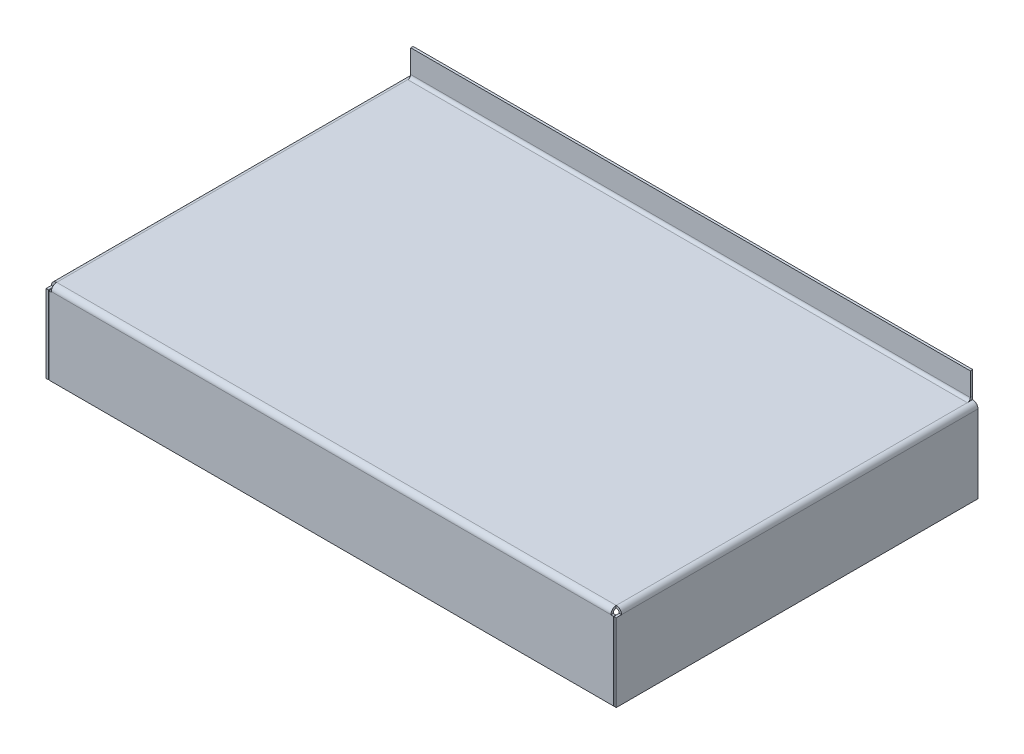
ISO-10303-21;
HEADER;
FILE_DESCRIPTION(('STEP AP214'),'2;1');
FILE_NAME('part.step','',(''),(''),'','','');
FILE_SCHEMA(('AUTOMOTIVE_DESIGN { 1 0 10303 214 1 1 1 1 }'));
ENDSEC;
DATA;
#1=APPLICATION_CONTEXT('core data for automotive mechanical design processes');
#2=APPLICATION_PROTOCOL_DEFINITION('international standard','automotive_design',2000,#1);
#3=PRODUCT_CONTEXT('',#1,'mechanical');
#4=PRODUCT('Part','Part','',(#3));
#5=PRODUCT_RELATED_PRODUCT_CATEGORY('part','',(#4));
#6=PRODUCT_DEFINITION_FORMATION('','',#4);
#7=PRODUCT_DEFINITION_CONTEXT('part definition',#1,'design');
#8=PRODUCT_DEFINITION('design','',#6,#7);
#9=PRODUCT_DEFINITION_SHAPE('','',#8);
#10=(LENGTH_UNIT() NAMED_UNIT(*) SI_UNIT(.MILLI.,.METRE.));
#11=(NAMED_UNIT(*) PLANE_ANGLE_UNIT() SI_UNIT($,.RADIAN.));
#12=(NAMED_UNIT(*) SI_UNIT($,.STERADIAN.) SOLID_ANGLE_UNIT());
#13=UNCERTAINTY_MEASURE_WITH_UNIT(LENGTH_MEASURE(1.E-05),#10,'distance_accuracy_value','');
#14=(GEOMETRIC_REPRESENTATION_CONTEXT(3) GLOBAL_UNCERTAINTY_ASSIGNED_CONTEXT((#13)) GLOBAL_UNIT_ASSIGNED_CONTEXT((#10,
#11,#12)) REPRESENTATION_CONTEXT('',''));
#15=CARTESIAN_POINT('',(0.,0.,0.));
#16=DIRECTION('',(0.,0.,1.));
#17=DIRECTION('',(1.,0.,0.));
#18=AXIS2_PLACEMENT_3D('',#15,#16,#17);
#19=CARTESIAN_POINT('',(-117.75,35.,0.));
#20=DIRECTION('',(1.,0.,0.));
#21=DIRECTION('',(0.,1.,0.));
#22=AXIS2_PLACEMENT_3D('',#19,#20,#21);
#23=PLANE('',#22);
#24=DIRECTION('',(0.,0.,-1.));
#25=VECTOR('',#24,1.);
#26=CARTESIAN_POINT('',(-117.75,35.,150.));
#27=LINE('',#26,#25);
#28=CARTESIAN_POINT('',(-117.75,35.,0.));
#29=VERTEX_POINT('',#28);
#30=CARTESIAN_POINT('',(-117.75,35.,0.379171306613024));
#31=VERTEX_POINT('',#30);
#32=EDGE_CURVE('E472',#29,#31,#27,.F.);
#33=ORIENTED_EDGE('',*,*,#32,.T.);
#34=CARTESIAN_POINT('',(-117.75,36.25,2.24999999999999));
#35=DIRECTION('',(-1.,0.,0.));
#36=DIRECTION('',(0.,0.,1.));
#37=AXIS2_PLACEMENT_3D('',#34,#35,#36);
#38=CIRCLE('',#37,2.25);
#39=CARTESIAN_POINT('',(-117.75,34.,2.25));
#40=VERTEX_POINT('',#39);
#41=EDGE_CURVE('E13',#31,#40,#38,.T.);
#42=ORIENTED_EDGE('',*,*,#41,.T.);
#43=DIRECTION('',(0.,0.,1.));
#44=VECTOR('',#43,1.);
#45=CARTESIAN_POINT('',(-117.75,34.,150.));
#46=LINE('',#45,#44);
#47=CARTESIAN_POINT('',(-117.75,34.,0.));
#48=VERTEX_POINT('',#47);
#49=EDGE_CURVE('E477',#48,#40,#46,.T.);
#50=ORIENTED_EDGE('',*,*,#49,.F.);
#51=DIRECTION('',(0.,1.,0.));
#52=VECTOR('',#51,1.);
#53=CARTESIAN_POINT('',(-117.75,35.,0.));
#54=LINE('',#53,#52);
#55=EDGE_CURVE('E535',#48,#29,#54,.T.);
#56=ORIENTED_EDGE('',*,*,#55,.T.);
#57=EDGE_LOOP('',(#33,#42,#50,#56));
#58=FACE_BOUND('',#57,.T.);
#59=ADVANCED_FACE('F98',(#58),#23,.T.);
#60=CARTESIAN_POINT('',(117.75,35.,2.24999999999999));
#61=DIRECTION('',(-1.,0.,0.));
#62=DIRECTION('',(0.,-1.,0.));
#63=AXIS2_PLACEMENT_3D('',#60,#61,#62);
#64=PLANE('',#63);
#65=DIRECTION('',(0.,0.,1.));
#66=VECTOR('',#65,1.);
#67=CARTESIAN_POINT('',(117.75,34.,150.));
#68=LINE('',#67,#66);
#69=CARTESIAN_POINT('',(117.75,34.,2.24999999999999));
#70=VERTEX_POINT('',#69);
#71=CARTESIAN_POINT('',(117.75,34.,0.));
#72=VERTEX_POINT('',#71);
#73=EDGE_CURVE('E486',#70,#72,#68,.F.);
#74=ORIENTED_EDGE('',*,*,#73,.F.);
#75=CARTESIAN_POINT('',(117.75,36.25,2.24999999999999));
#76=DIRECTION('',(-1.,0.,0.));
#77=DIRECTION('',(0.,0.,1.));
#78=AXIS2_PLACEMENT_3D('',#75,#76,#77);
#79=CIRCLE('',#78,2.25);
#80=CARTESIAN_POINT('',(117.75,35.,0.379171306613013));
#81=VERTEX_POINT('',#80);
#82=EDGE_CURVE('E423',#70,#81,#79,.F.);
#83=ORIENTED_EDGE('',*,*,#82,.T.);
#84=DIRECTION('',(0.,0.,-1.));
#85=VECTOR('',#84,1.);
#86=CARTESIAN_POINT('',(117.75,35.,2.24999999999999));
#87=LINE('',#86,#85);
#88=CARTESIAN_POINT('',(117.75,35.,0.));
#89=VERTEX_POINT('',#88);
#90=EDGE_CURVE('E425',#81,#89,#87,.T.);
#91=ORIENTED_EDGE('',*,*,#90,.T.);
#92=DIRECTION('',(0.,1.,0.));
#93=VECTOR('',#92,1.);
#94=CARTESIAN_POINT('',(117.75,35.,0.));
#95=LINE('',#94,#93);
#96=EDGE_CURVE('E107',#72,#89,#95,.T.);
#97=ORIENTED_EDGE('',*,*,#96,.F.);
#98=EDGE_LOOP('',(#74,#83,#91,#97));
#99=FACE_BOUND('',#98,.T.);
#100=ADVANCED_FACE('F566',(#99),#64,.T.);
#101=CARTESIAN_POINT('',(-120.,35.,150.));
#102=DIRECTION('',(0.,-1.,0.));
#103=DIRECTION('',(1.,0.,0.));
#104=AXIS2_PLACEMENT_3D('',#101,#102,#103);
#105=PLANE('',#104);
#106=DIRECTION('',(-1.,0.,0.));
#107=VECTOR('',#106,1.);
#108=CARTESIAN_POINT('',(-117.75,35.,2.24999999999999));
#109=LINE('',#108,#107);
#110=CARTESIAN_POINT('',(-117.75,35.,2.24999999999999));
#111=VERTEX_POINT('',#110);
#112=CARTESIAN_POINT('',(117.75,35.,2.24999999999999));
#113=VERTEX_POINT('',#112);
#114=EDGE_CURVE('E431',#111,#113,#109,.F.);
#115=ORIENTED_EDGE('',*,*,#114,.F.);
#116=CARTESIAN_POINT('',(-117.75,35.,150.));
#117=VERTEX_POINT('',#116);
#118=EDGE_CURVE('E471',#111,#117,#27,.F.);
#119=ORIENTED_EDGE('',*,*,#118,.T.);
#120=DIRECTION('',(-1.,0.,0.));
#121=VECTOR('',#120,1.);
#122=CARTESIAN_POINT('',(-120.,35.,150.));
#123=LINE('',#122,#121);
#124=CARTESIAN_POINT('',(117.75,35.,150.));
#125=VERTEX_POINT('',#124);
#126=EDGE_CURVE('E447',#125,#117,#123,.T.);
#127=ORIENTED_EDGE('',*,*,#126,.F.);
#128=DIRECTION('',(0.,0.,-1.));
#129=VECTOR('',#128,1.);
#130=CARTESIAN_POINT('',(117.75,35.,150.));
#131=LINE('',#130,#129);
#132=EDGE_CURVE('E456',#125,#113,#131,.T.);
#133=ORIENTED_EDGE('',*,*,#132,.T.);
#134=EDGE_LOOP('',(#115,#119,#127,#133));
#135=FACE_BOUND('',#134,.T.);
#136=ADVANCED_FACE('F578',(#135),#105,.F.);
#137=CARTESIAN_POINT('',(-120.,34.,150.));
#138=DIRECTION('',(0.,-1.,0.));
#139=DIRECTION('',(1.,0.,0.));
#140=AXIS2_PLACEMENT_3D('',#137,#138,#139);
#141=PLANE('',#140);
#142=CARTESIAN_POINT('',(-117.75,34.,150.));
#143=VERTEX_POINT('',#142);
#144=EDGE_CURVE('E489',#40,#143,#46,.T.);
#145=ORIENTED_EDGE('',*,*,#144,.F.);
#146=DIRECTION('',(-1.,0.,0.));
#147=VECTOR('',#146,1.);
#148=CARTESIAN_POINT('',(-117.75,34.,2.24999999999999));
#149=LINE('',#148,#147);
#150=EDGE_CURVE('E419',#40,#70,#149,.F.);
#151=ORIENTED_EDGE('',*,*,#150,.T.);
#152=CARTESIAN_POINT('',(117.75,34.,150.));
#153=VERTEX_POINT('',#152);
#154=EDGE_CURVE('E483',#153,#70,#68,.F.);
#155=ORIENTED_EDGE('',*,*,#154,.F.);
#156=DIRECTION('',(1.,0.,0.));
#157=VECTOR('',#156,1.);
#158=CARTESIAN_POINT('',(-120.,34.,150.));
#159=LINE('',#158,#157);
#160=EDGE_CURVE('E496',#153,#143,#159,.F.);
#161=ORIENTED_EDGE('',*,*,#160,.T.);
#162=EDGE_LOOP('',(#145,#151,#155,#161));
#163=FACE_BOUND('',#162,.T.);
#164=ADVANCED_FACE('F569',(#163),#141,.T.);
#165=CARTESIAN_POINT('',(-117.75,32.75,0.));
#166=DIRECTION('',(0.,0.,1.));
#167=DIRECTION('',(1.,0.,0.));
#168=AXIS2_PLACEMENT_3D('',#165,#166,#167);
#169=PLANE('',#168);
#170=ORIENTED_EDGE('',*,*,#55,.F.);
#171=CARTESIAN_POINT('',(-117.75,32.75,0.));
#172=DIRECTION('',(0.,0.,-1.));
#173=DIRECTION('',(-1.,0.,0.));
#174=AXIS2_PLACEMENT_3D('',#171,#172,#173);
#175=CIRCLE('',#174,1.25);
#176=CARTESIAN_POINT('',(-119.,32.75,0.));
#177=VERTEX_POINT('',#176);
#178=EDGE_CURVE('E439',#48,#177,#175,.F.);
#179=ORIENTED_EDGE('',*,*,#178,.T.);
#180=DIRECTION('',(-1.,0.,0.));
#181=VECTOR('',#180,1.);
#182=CARTESIAN_POINT('',(-120.,32.75,0.));
#183=LINE('',#182,#181);
#184=CARTESIAN_POINT('',(-120.,32.75,0.));
#185=VERTEX_POINT('',#184);
#186=EDGE_CURVE('E533',#177,#185,#183,.T.);
#187=ORIENTED_EDGE('',*,*,#186,.T.);
#188=CARTESIAN_POINT('',(-117.75,32.75,0.));
#189=DIRECTION('',(0.,0.,-1.));
#190=DIRECTION('',(-1.,0.,0.));
#191=AXIS2_PLACEMENT_3D('',#188,#189,#190);
#192=CIRCLE('',#191,2.25);
#193=EDGE_CURVE('E474',#29,#185,#192,.F.);
#194=ORIENTED_EDGE('',*,*,#193,.F.);
#195=EDGE_LOOP('',(#170,#179,#187,#194));
#196=FACE_BOUND('',#195,.T.);
#197=ADVANCED_FACE('F640',(#196),#169,.F.);
#198=CARTESIAN_POINT('',(-120.,0.,0.));
#199=DIRECTION('',(0.,0.,1.));
#200=DIRECTION('',(0.,-1.,0.));
#201=AXIS2_PLACEMENT_3D('',#198,#199,#200);
#202=PLANE('',#201);
#203=ORIENTED_EDGE('',*,*,#186,.F.);
#204=DIRECTION('',(0.,1.,0.));
#205=VECTOR('',#204,1.);
#206=CARTESIAN_POINT('',(-119.,0.,0.));
#207=LINE('',#206,#205);
#208=CARTESIAN_POINT('',(-119.,0.,0.));
#209=VERTEX_POINT('',#208);
#210=EDGE_CURVE('E502',#177,#209,#207,.F.);
#211=ORIENTED_EDGE('',*,*,#210,.T.);
#212=DIRECTION('',(-1.,0.,0.));
#213=VECTOR('',#212,1.);
#214=CARTESIAN_POINT('',(-120.,0.,0.));
#215=LINE('',#214,#213);
#216=CARTESIAN_POINT('',(-120.,0.,0.));
#217=VERTEX_POINT('',#216);
#218=EDGE_CURVE('E531',#209,#217,#215,.T.);
#219=ORIENTED_EDGE('',*,*,#218,.T.);
#220=DIRECTION('',(0.,-1.,0.));
#221=VECTOR('',#220,1.);
#222=CARTESIAN_POINT('',(-120.,0.,0.));
#223=LINE('',#222,#221);
#224=EDGE_CURVE('E440',#185,#217,#223,.T.);
#225=ORIENTED_EDGE('',*,*,#224,.F.);
#226=EDGE_LOOP('',(#203,#211,#219,#225));
#227=FACE_BOUND('',#226,.T.);
#228=ADVANCED_FACE('F667',(#227),#202,.F.);
#229=CARTESIAN_POINT('',(-120.,0.,150.));
#230=DIRECTION('',(0.,-1.,0.));
#231=DIRECTION('',(0.,0.,-1.));
#232=AXIS2_PLACEMENT_3D('',#229,#230,#231);
#233=PLANE('',#232);
#234=ORIENTED_EDGE('',*,*,#218,.F.);
#235=DIRECTION('',(0.,0.,-1.));
#236=VECTOR('',#235,1.);
#237=CARTESIAN_POINT('',(-119.,0.,150.));
#238=LINE('',#237,#236);
#239=CARTESIAN_POINT('',(-119.,0.,152.25));
#240=VERTEX_POINT('',#239);
#241=EDGE_CURVE('E506',#240,#209,#238,.T.);
#242=ORIENTED_EDGE('',*,*,#241,.F.);
#243=DIRECTION('',(1.,0.,0.));
#244=VECTOR('',#243,1.);
#245=CARTESIAN_POINT('',(-120.,0.,152.25));
#246=LINE('',#245,#244);
#247=CARTESIAN_POINT('',(-120.,0.,152.25));
#248=VERTEX_POINT('',#247);
#249=EDGE_CURVE('E375',#248,#240,#246,.T.);
#250=ORIENTED_EDGE('',*,*,#249,.F.);
#251=DIRECTION('',(0.,0.,-1.));
#252=VECTOR('',#251,1.);
#253=CARTESIAN_POINT('',(-120.,0.,150.));
#254=LINE('',#253,#252);
#255=EDGE_CURVE('E443',#248,#217,#254,.T.);
#256=ORIENTED_EDGE('',*,*,#255,.T.);
#257=EDGE_LOOP('',(#234,#242,#250,#256));
#258=FACE_BOUND('',#257,.T.);
#259=ADVANCED_FACE('F663',(#258),#233,.T.);
#260=CARTESIAN_POINT('',(-117.75,32.75,150.));
#261=DIRECTION('',(0.,0.,-1.));
#262=DIRECTION('',(-1.,0.,0.));
#263=AXIS2_PLACEMENT_3D('',#260,#261,#262);
#264=PLANE('',#263);
#265=DIRECTION('',(-1.,0.,0.));
#266=VECTOR('',#265,1.);
#267=CARTESIAN_POINT('',(-120.,32.75,150.));
#268=LINE('',#267,#266);
#269=CARTESIAN_POINT('',(-119.,32.75,150.));
#270=VERTEX_POINT('',#269);
#271=CARTESIAN_POINT('',(-120.,32.75,150.));
#272=VERTEX_POINT('',#271);
#273=EDGE_CURVE('E529',#270,#272,#268,.T.);
#274=ORIENTED_EDGE('',*,*,#273,.F.);
#275=CARTESIAN_POINT('',(-117.75,32.75,150.));
#276=DIRECTION('',(0.,0.,-1.));
#277=DIRECTION('',(-1.,0.,0.));
#278=AXIS2_PLACEMENT_3D('',#275,#276,#277);
#279=CIRCLE('',#278,1.25);
#280=EDGE_CURVE('E507',#270,#143,#279,.T.);
#281=ORIENTED_EDGE('',*,*,#280,.T.);
#282=DIRECTION('',(0.,1.,0.));
#283=VECTOR('',#282,1.);
#284=CARTESIAN_POINT('',(-117.75,35.,150.));
#285=LINE('',#284,#283);
#286=EDGE_CURVE('E526',#143,#117,#285,.T.);
#287=ORIENTED_EDGE('',*,*,#286,.T.);
#288=CARTESIAN_POINT('',(-117.75,32.75,150.));
#289=DIRECTION('',(0.,0.,1.));
#290=DIRECTION('',(1.,0.,0.));
#291=AXIS2_PLACEMENT_3D('',#288,#289,#290);
#292=CIRCLE('',#291,2.25);
#293=EDGE_CURVE('E466',#272,#117,#292,.F.);
#294=ORIENTED_EDGE('',*,*,#293,.F.);
#295=EDGE_LOOP('',(#274,#281,#287,#294));
#296=FACE_BOUND('',#295,.T.);
#297=ADVANCED_FACE('F659',(#296),#264,.F.);
#298=CARTESIAN_POINT('',(117.75,32.75,150.));
#299=DIRECTION('',(0.,0.,-1.));
#300=DIRECTION('',(-1.,0.,0.));
#301=AXIS2_PLACEMENT_3D('',#298,#299,#300);
#302=PLANE('',#301);
#303=DIRECTION('',(0.,1.,0.));
#304=VECTOR('',#303,1.);
#305=CARTESIAN_POINT('',(117.75,35.,150.));
#306=LINE('',#305,#304);
#307=EDGE_CURVE('E523',#153,#125,#306,.T.);
#308=ORIENTED_EDGE('',*,*,#307,.F.);
#309=CARTESIAN_POINT('',(117.75,32.75,150.));
#310=DIRECTION('',(0.,0.,-1.));
#311=DIRECTION('',(-1.,0.,0.));
#312=AXIS2_PLACEMENT_3D('',#309,#310,#311);
#313=CIRCLE('',#312,1.25);
#314=CARTESIAN_POINT('',(119.,32.75,150.));
#315=VERTEX_POINT('',#314);
#316=EDGE_CURVE('E499',#153,#315,#313,.T.);
#317=ORIENTED_EDGE('',*,*,#316,.T.);
#318=DIRECTION('',(1.,0.,0.));
#319=VECTOR('',#318,1.);
#320=CARTESIAN_POINT('',(120.,32.75,150.));
#321=LINE('',#320,#319);
#322=CARTESIAN_POINT('',(120.,32.75,150.));
#323=VERTEX_POINT('',#322);
#324=EDGE_CURVE('E520',#315,#323,#321,.T.);
#325=ORIENTED_EDGE('',*,*,#324,.T.);
#326=CARTESIAN_POINT('',(117.75,32.75,150.));
#327=DIRECTION('',(0.,0.,1.));
#328=DIRECTION('',(1.,0.,0.));
#329=AXIS2_PLACEMENT_3D('',#326,#327,#328);
#330=CIRCLE('',#329,2.25);
#331=EDGE_CURVE('E444',#125,#323,#330,.F.);
#332=ORIENTED_EDGE('',*,*,#331,.F.);
#333=EDGE_LOOP('',(#308,#317,#325,#332));
#334=FACE_BOUND('',#333,.T.);
#335=ADVANCED_FACE('F655',(#334),#302,.F.);
#336=CARTESIAN_POINT('',(120.,0.,150.));
#337=DIRECTION('',(0.,1.,0.));
#338=DIRECTION('',(0.,0.,-1.));
#339=AXIS2_PLACEMENT_3D('',#336,#337,#338);
#340=PLANE('',#339);
#341=DIRECTION('',(0.,0.,-1.));
#342=VECTOR('',#341,1.);
#343=CARTESIAN_POINT('',(120.,0.,150.));
#344=LINE('',#343,#342);
#345=CARTESIAN_POINT('',(120.,0.,152.25));
#346=VERTEX_POINT('',#345);
#347=CARTESIAN_POINT('',(120.,0.,0.));
#348=VERTEX_POINT('',#347);
#349=EDGE_CURVE('E453',#346,#348,#344,.T.);
#350=ORIENTED_EDGE('',*,*,#349,.F.);
#351=DIRECTION('',(1.,0.,0.));
#352=VECTOR('',#351,1.);
#353=CARTESIAN_POINT('',(119.,0.,152.25));
#354=LINE('',#353,#352);
#355=CARTESIAN_POINT('',(119.,0.,152.25));
#356=VERTEX_POINT('',#355);
#357=EDGE_CURVE('E365',#356,#346,#354,.T.);
#358=ORIENTED_EDGE('',*,*,#357,.F.);
#359=DIRECTION('',(0.,0.,1.));
#360=VECTOR('',#359,1.);
#361=CARTESIAN_POINT('',(119.,0.,150.));
#362=LINE('',#361,#360);
#363=CARTESIAN_POINT('',(119.,0.,0.));
#364=VERTEX_POINT('',#363);
#365=EDGE_CURVE('E495',#356,#364,#362,.F.);
#366=ORIENTED_EDGE('',*,*,#365,.T.);
#367=DIRECTION('',(1.,0.,0.));
#368=VECTOR('',#367,1.);
#369=CARTESIAN_POINT('',(120.,0.,0.));
#370=LINE('',#369,#368);
#371=EDGE_CURVE('E518',#364,#348,#370,.T.);
#372=ORIENTED_EDGE('',*,*,#371,.T.);
#373=EDGE_LOOP('',(#350,#358,#366,#372));
#374=FACE_BOUND('',#373,.T.);
#375=ADVANCED_FACE('F652',(#374),#340,.F.);
#376=CARTESIAN_POINT('',(120.,35.,0.));
#377=DIRECTION('',(0.,0.,1.));
#378=DIRECTION('',(0.,1.,0.));
#379=AXIS2_PLACEMENT_3D('',#376,#377,#378);
#380=PLANE('',#379);
#381=ORIENTED_EDGE('',*,*,#371,.F.);
#382=DIRECTION('',(0.,1.,0.));
#383=VECTOR('',#382,1.);
#384=CARTESIAN_POINT('',(119.,35.,0.));
#385=LINE('',#384,#383);
#386=CARTESIAN_POINT('',(119.,32.75,0.));
#387=VERTEX_POINT('',#386);
#388=EDGE_CURVE('E492',#364,#387,#385,.T.);
#389=ORIENTED_EDGE('',*,*,#388,.T.);
#390=DIRECTION('',(1.,0.,0.));
#391=VECTOR('',#390,1.);
#392=CARTESIAN_POINT('',(120.,32.75,0.));
#393=LINE('',#392,#391);
#394=CARTESIAN_POINT('',(120.,32.75,0.));
#395=VERTEX_POINT('',#394);
#396=EDGE_CURVE('E102',#387,#395,#393,.T.);
#397=ORIENTED_EDGE('',*,*,#396,.T.);
#398=DIRECTION('',(0.,1.,0.));
#399=VECTOR('',#398,1.);
#400=CARTESIAN_POINT('',(120.,35.,0.));
#401=LINE('',#400,#399);
#402=EDGE_CURVE('E450',#348,#395,#401,.T.);
#403=ORIENTED_EDGE('',*,*,#402,.F.);
#404=EDGE_LOOP('',(#381,#389,#397,#403));
#405=FACE_BOUND('',#404,.T.);
#406=ADVANCED_FACE('F553',(#405),#380,.F.);
#407=CARTESIAN_POINT('',(117.75,32.75,0.));
#408=DIRECTION('',(0.,0.,1.));
#409=DIRECTION('',(1.,0.,0.));
#410=AXIS2_PLACEMENT_3D('',#407,#408,#409);
#411=PLANE('',#410);
#412=CARTESIAN_POINT('',(117.75,32.75,0.));
#413=DIRECTION('',(0.,0.,-1.));
#414=DIRECTION('',(-1.,0.,0.));
#415=AXIS2_PLACEMENT_3D('',#412,#413,#414);
#416=CIRCLE('',#415,1.25);
#417=EDGE_CURVE('E503',#387,#72,#416,.F.);
#418=ORIENTED_EDGE('',*,*,#417,.T.);
#419=ORIENTED_EDGE('',*,*,#96,.T.);
#420=CARTESIAN_POINT('',(117.75,32.75,0.));
#421=DIRECTION('',(0.,0.,-1.));
#422=DIRECTION('',(-1.,0.,0.));
#423=AXIS2_PLACEMENT_3D('',#420,#421,#422);
#424=CIRCLE('',#423,2.25);
#425=EDGE_CURVE('E463',#395,#89,#424,.F.);
#426=ORIENTED_EDGE('',*,*,#425,.F.);
#427=ORIENTED_EDGE('',*,*,#396,.F.);
#428=EDGE_LOOP('',(#418,#419,#426,#427));
#429=FACE_BOUND('',#428,.T.);
#430=ADVANCED_FACE('F100',(#429),#411,.F.);
#431=CARTESIAN_POINT('',(120.,35.,150.));
#432=DIRECTION('',(-1.,0.,0.));
#433=DIRECTION('',(0.,0.,1.));
#434=AXIS2_PLACEMENT_3D('',#431,#432,#433);
#435=PLANE('',#434);
#436=ORIENTED_EDGE('',*,*,#402,.T.);
#437=DIRECTION('',(0.,0.,-1.));
#438=VECTOR('',#437,1.);
#439=CARTESIAN_POINT('',(120.,32.75,150.));
#440=LINE('',#439,#438);
#441=EDGE_CURVE('E459',#395,#323,#440,.F.);
#442=ORIENTED_EDGE('',*,*,#441,.T.);
#443=DIRECTION('',(0.,0.,-1.));
#444=VECTOR('',#443,1.);
#445=CARTESIAN_POINT('',(120.,32.75,152.25));
#446=LINE('',#445,#444);
#447=CARTESIAN_POINT('',(120.,32.75,152.25));
#448=VERTEX_POINT('',#447);
#449=EDGE_CURVE('E370',#448,#323,#446,.T.);
#450=ORIENTED_EDGE('',*,*,#449,.F.);
#451=DIRECTION('',(0.,1.,0.));
#452=VECTOR('',#451,1.);
#453=CARTESIAN_POINT('',(120.,0.,152.25));
#454=LINE('',#453,#452);
#455=EDGE_CURVE('E347',#346,#448,#454,.T.);
#456=ORIENTED_EDGE('',*,*,#455,.F.);
#457=ORIENTED_EDGE('',*,*,#349,.T.);
#458=EDGE_LOOP('',(#436,#442,#450,#456,#457));
#459=FACE_BOUND('',#458,.T.);
#460=ADVANCED_FACE('F549',(#459),#435,.F.);
#461=CARTESIAN_POINT('',(-120.,0.,150.));
#462=DIRECTION('',(1.,0.,0.));
#463=DIRECTION('',(0.,0.,-1.));
#464=AXIS2_PLACEMENT_3D('',#461,#462,#463);
#465=PLANE('',#464);
#466=ORIENTED_EDGE('',*,*,#255,.F.);
#467=DIRECTION('',(0.,-1.,0.));
#468=VECTOR('',#467,1.);
#469=CARTESIAN_POINT('',(-120.,32.75,152.25));
#470=LINE('',#469,#468);
#471=CARTESIAN_POINT('',(-120.,32.75,152.25));
#472=VERTEX_POINT('',#471);
#473=EDGE_CURVE('E372',#472,#248,#470,.T.);
#474=ORIENTED_EDGE('',*,*,#473,.F.);
#475=DIRECTION('',(0.,0.,-1.));
#476=VECTOR('',#475,1.);
#477=CARTESIAN_POINT('',(-120.,32.75,152.25));
#478=LINE('',#477,#476);
#479=EDGE_CURVE('E382',#472,#272,#478,.T.);
#480=ORIENTED_EDGE('',*,*,#479,.T.);
#481=DIRECTION('',(0.,0.,-1.));
#482=VECTOR('',#481,1.);
#483=CARTESIAN_POINT('',(-120.,32.75,150.));
#484=LINE('',#483,#482);
#485=EDGE_CURVE('E462',#272,#185,#484,.T.);
#486=ORIENTED_EDGE('',*,*,#485,.T.);
#487=ORIENTED_EDGE('',*,*,#224,.T.);
#488=EDGE_LOOP('',(#466,#474,#480,#486,#487));
#489=FACE_BOUND('',#488,.T.);
#490=ADVANCED_FACE('F622',(#489),#465,.F.);
#491=CARTESIAN_POINT('',(117.75,32.75,150.));
#492=DIRECTION('',(0.,0.,-1.));
#493=DIRECTION('',(-1.,0.,0.));
#494=AXIS2_PLACEMENT_3D('',#491,#492,#493);
#495=CYLINDRICAL_SURFACE('',#494,2.25);
#496=ORIENTED_EDGE('',*,*,#331,.T.);
#497=ORIENTED_EDGE('',*,*,#441,.F.);
#498=ORIENTED_EDGE('',*,*,#425,.T.);
#499=ORIENTED_EDGE('',*,*,#90,.F.);
#500=EDGE_CURVE('E436',#113,#81,#87,.T.);
#501=ORIENTED_EDGE('',*,*,#500,.F.);
#502=ORIENTED_EDGE('',*,*,#132,.F.);
#503=EDGE_LOOP('',(#496,#497,#498,#499,#501,#502));
#504=FACE_BOUND('',#503,.T.);
#505=ADVANCED_FACE('F544',(#504),#495,.T.);
#506=CARTESIAN_POINT('',(-117.75,32.75,150.));
#507=DIRECTION('',(0.,0.,-1.));
#508=DIRECTION('',(-1.,0.,0.));
#509=AXIS2_PLACEMENT_3D('',#506,#507,#508);
#510=CYLINDRICAL_SURFACE('',#509,2.25);
#511=ORIENTED_EDGE('',*,*,#293,.T.);
#512=ORIENTED_EDGE('',*,*,#118,.F.);
#513=EDGE_CURVE('E116',#31,#111,#27,.F.);
#514=ORIENTED_EDGE('',*,*,#513,.F.);
#515=ORIENTED_EDGE('',*,*,#32,.F.);
#516=ORIENTED_EDGE('',*,*,#193,.T.);
#517=ORIENTED_EDGE('',*,*,#485,.F.);
#518=EDGE_LOOP('',(#511,#512,#514,#515,#516,#517));
#519=FACE_BOUND('',#518,.T.);
#520=ADVANCED_FACE('F632',(#519),#510,.T.);
#521=CARTESIAN_POINT('',(119.,35.,150.));
#522=DIRECTION('',(-1.,0.,0.));
#523=DIRECTION('',(0.,0.,1.));
#524=AXIS2_PLACEMENT_3D('',#521,#522,#523);
#525=PLANE('',#524);
#526=ORIENTED_EDGE('',*,*,#388,.F.);
#527=ORIENTED_EDGE('',*,*,#365,.F.);
#528=DIRECTION('',(0.,-1.,0.));
#529=VECTOR('',#528,1.);
#530=CARTESIAN_POINT('',(119.,32.75,152.25));
#531=LINE('',#530,#529);
#532=CARTESIAN_POINT('',(119.,32.75,152.25));
#533=VERTEX_POINT('',#532);
#534=EDGE_CURVE('E362',#533,#356,#531,.T.);
#535=ORIENTED_EDGE('',*,*,#534,.F.);
#536=DIRECTION('',(0.,0.,-1.));
#537=VECTOR('',#536,1.);
#538=CARTESIAN_POINT('',(119.,32.75,152.25));
#539=LINE('',#538,#537);
#540=EDGE_CURVE('E368',#533,#315,#539,.T.);
#541=ORIENTED_EDGE('',*,*,#540,.T.);
#542=DIRECTION('',(0.,0.,1.));
#543=VECTOR('',#542,1.);
#544=CARTESIAN_POINT('',(119.,32.75,150.));
#545=LINE('',#544,#543);
#546=EDGE_CURVE('E479',#387,#315,#545,.T.);
#547=ORIENTED_EDGE('',*,*,#546,.F.);
#548=EDGE_LOOP('',(#526,#527,#535,#541,#547));
#549=FACE_BOUND('',#548,.T.);
#550=ADVANCED_FACE('F557',(#549),#525,.T.);
#551=CARTESIAN_POINT('',(-119.,0.,150.));
#552=DIRECTION('',(1.,0.,0.));
#553=DIRECTION('',(0.,0.,-1.));
#554=AXIS2_PLACEMENT_3D('',#551,#552,#553);
#555=PLANE('',#554);
#556=DIRECTION('',(0.,0.,-1.));
#557=VECTOR('',#556,1.);
#558=CARTESIAN_POINT('',(-119.,32.75,150.));
#559=LINE('',#558,#557);
#560=EDGE_CURVE('E482',#270,#177,#559,.T.);
#561=ORIENTED_EDGE('',*,*,#560,.F.);
#562=DIRECTION('',(0.,0.,-1.));
#563=VECTOR('',#562,1.);
#564=CARTESIAN_POINT('',(-119.,32.75,152.25));
#565=LINE('',#564,#563);
#566=CARTESIAN_POINT('',(-119.,32.75,152.25));
#567=VERTEX_POINT('',#566);
#568=EDGE_CURVE('E385',#567,#270,#565,.T.);
#569=ORIENTED_EDGE('',*,*,#568,.F.);
#570=DIRECTION('',(0.,1.,0.));
#571=VECTOR('',#570,1.);
#572=CARTESIAN_POINT('',(-119.,0.,152.25));
#573=LINE('',#572,#571);
#574=EDGE_CURVE('E378',#240,#567,#573,.T.);
#575=ORIENTED_EDGE('',*,*,#574,.F.);
#576=ORIENTED_EDGE('',*,*,#241,.T.);
#577=ORIENTED_EDGE('',*,*,#210,.F.);
#578=EDGE_LOOP('',(#561,#569,#575,#576,#577));
#579=FACE_BOUND('',#578,.T.);
#580=ADVANCED_FACE('F637',(#579),#555,.T.);
#581=CARTESIAN_POINT('',(117.75,32.75,150.));
#582=DIRECTION('',(0.,0.,-1.));
#583=DIRECTION('',(-1.,0.,0.));
#584=AXIS2_PLACEMENT_3D('',#581,#582,#583);
#585=CYLINDRICAL_SURFACE('',#584,1.25);
#586=ORIENTED_EDGE('',*,*,#316,.F.);
#587=ORIENTED_EDGE('',*,*,#154,.T.);
#588=ORIENTED_EDGE('',*,*,#73,.T.);
#589=ORIENTED_EDGE('',*,*,#417,.F.);
#590=ORIENTED_EDGE('',*,*,#546,.T.);
#591=EDGE_LOOP('',(#586,#587,#588,#589,#590));
#592=FACE_BOUND('',#591,.T.);
#593=ADVANCED_FACE('F563',(#592),#585,.F.);
#594=CARTESIAN_POINT('',(-117.75,32.75,150.));
#595=DIRECTION('',(0.,0.,-1.));
#596=DIRECTION('',(-1.,0.,0.));
#597=AXIS2_PLACEMENT_3D('',#594,#595,#596);
#598=CYLINDRICAL_SURFACE('',#597,1.25);
#599=ORIENTED_EDGE('',*,*,#280,.F.);
#600=ORIENTED_EDGE('',*,*,#560,.T.);
#601=ORIENTED_EDGE('',*,*,#178,.F.);
#602=ORIENTED_EDGE('',*,*,#49,.T.);
#603=ORIENTED_EDGE('',*,*,#144,.T.);
#604=EDGE_LOOP('',(#599,#600,#601,#602,#603));
#605=FACE_BOUND('',#604,.T.);
#606=ADVANCED_FACE('F646',(#605),#598,.F.);
#607=CARTESIAN_POINT('',(117.75,36.25,2.24999999999999));
#608=DIRECTION('',(1.,0.,0.));
#609=DIRECTION('',(0.,0.,-1.));
#610=AXIS2_PLACEMENT_3D('',#607,#608,#609);
#611=PLANE('',#610);
#612=CARTESIAN_POINT('',(117.75,36.25,2.24999999999999));
#613=DIRECTION('',(-1.,0.,0.));
#614=DIRECTION('',(0.,0.,1.));
#615=AXIS2_PLACEMENT_3D('',#612,#613,#614);
#616=CIRCLE('',#615,1.25);
#617=CARTESIAN_POINT('',(117.75,36.25,0.999999999999994));
#618=VERTEX_POINT('',#617);
#619=EDGE_CURVE('E428',#113,#618,#616,.F.);
#620=ORIENTED_EDGE('',*,*,#619,.F.);
#621=ORIENTED_EDGE('',*,*,#500,.T.);
#622=CARTESIAN_POINT('',(117.75,36.25,0.));
#623=VERTEX_POINT('',#622);
#624=EDGE_CURVE('E422',#81,#623,#79,.F.);
#625=ORIENTED_EDGE('',*,*,#624,.T.);
#626=DIRECTION('',(0.,0.,1.));
#627=VECTOR('',#626,1.);
#628=CARTESIAN_POINT('',(117.75,36.25,0.));
#629=LINE('',#628,#627);
#630=EDGE_CURVE('E387',#618,#623,#629,.F.);
#631=ORIENTED_EDGE('',*,*,#630,.F.);
#632=EDGE_LOOP('',(#620,#621,#625,#631));
#633=FACE_BOUND('',#632,.T.);
#634=ADVANCED_FACE('F576',(#633),#611,.T.);
#635=CARTESIAN_POINT('',(-117.75,36.25,2.24999999999999));
#636=DIRECTION('',(1.,0.,0.));
#637=DIRECTION('',(0.,0.,-1.));
#638=AXIS2_PLACEMENT_3D('',#635,#636,#637);
#639=PLANE('',#638);
#640=CARTESIAN_POINT('',(-117.75,36.25,0.));
#641=VERTEX_POINT('',#640);
#642=EDGE_CURVE('E109',#641,#31,#38,.T.);
#643=ORIENTED_EDGE('',*,*,#642,.T.);
#644=ORIENTED_EDGE('',*,*,#513,.T.);
#645=CARTESIAN_POINT('',(-117.75,36.25,2.24999999999999));
#646=DIRECTION('',(-1.,0.,0.));
#647=DIRECTION('',(0.,0.,1.));
#648=AXIS2_PLACEMENT_3D('',#645,#646,#647);
#649=CIRCLE('',#648,1.25);
#650=CARTESIAN_POINT('',(-117.75,36.25,0.999999999999994));
#651=VERTEX_POINT('',#650);
#652=EDGE_CURVE('E391',#651,#111,#649,.T.);
#653=ORIENTED_EDGE('',*,*,#652,.F.);
#654=DIRECTION('',(0.,0.,1.));
#655=VECTOR('',#654,1.);
#656=CARTESIAN_POINT('',(-117.75,36.25,0.999999999999993));
#657=LINE('',#656,#655);
#658=EDGE_CURVE('E412',#651,#641,#657,.F.);
#659=ORIENTED_EDGE('',*,*,#658,.T.);
#660=EDGE_LOOP('',(#643,#644,#653,#659));
#661=FACE_BOUND('',#660,.T.);
#662=ADVANCED_FACE('F586',(#661),#639,.F.);
#663=CARTESIAN_POINT('',(-117.75,36.25,2.24999999999999));
#664=DIRECTION('',(-1.,0.,0.));
#665=DIRECTION('',(0.,0.,-1.));
#666=AXIS2_PLACEMENT_3D('',#663,#664,#665);
#667=CYLINDRICAL_SURFACE('',#666,2.25);
#668=ORIENTED_EDGE('',*,*,#150,.F.);
#669=ORIENTED_EDGE('',*,*,#41,.F.);
#670=ORIENTED_EDGE('',*,*,#642,.F.);
#671=DIRECTION('',(-1.,0.,0.));
#672=VECTOR('',#671,1.);
#673=CARTESIAN_POINT('',(117.75,36.25,0.));
#674=LINE('',#673,#672);
#675=EDGE_CURVE('E409',#641,#623,#674,.F.);
#676=ORIENTED_EDGE('',*,*,#675,.T.);
#677=ORIENTED_EDGE('',*,*,#624,.F.);
#678=ORIENTED_EDGE('',*,*,#82,.F.);
#679=EDGE_LOOP('',(#668,#669,#670,#676,#677,#678));
#680=FACE_BOUND('',#679,.T.);
#681=ADVANCED_FACE('F571',(#680),#667,.T.);
#682=CARTESIAN_POINT('',(-117.75,36.25,2.24999999999999));
#683=DIRECTION('',(-1.,0.,0.));
#684=DIRECTION('',(0.,0.,-1.));
#685=AXIS2_PLACEMENT_3D('',#682,#683,#684);
#686=CYLINDRICAL_SURFACE('',#685,1.25);
#687=ORIENTED_EDGE('',*,*,#114,.T.);
#688=ORIENTED_EDGE('',*,*,#619,.T.);
#689=DIRECTION('',(-1.,0.,0.));
#690=VECTOR('',#689,1.);
#691=CARTESIAN_POINT('',(117.75,36.25,0.999999999999993));
#692=LINE('',#691,#690);
#693=EDGE_CURVE('E415',#618,#651,#692,.T.);
#694=ORIENTED_EDGE('',*,*,#693,.T.);
#695=ORIENTED_EDGE('',*,*,#652,.T.);
#696=EDGE_LOOP('',(#687,#688,#694,#695));
#697=FACE_BOUND('',#696,.T.);
#698=ADVANCED_FACE('F581',(#697),#686,.F.);
#699=CARTESIAN_POINT('',(-117.75,46.,0.));
#700=DIRECTION('',(1.,0.,0.));
#701=DIRECTION('',(0.,0.,-1.));
#702=AXIS2_PLACEMENT_3D('',#699,#700,#701);
#703=PLANE('',#702);
#704=ORIENTED_EDGE('',*,*,#658,.F.);
#705=DIRECTION('',(0.,-1.,0.));
#706=VECTOR('',#705,1.);
#707=CARTESIAN_POINT('',(-117.75,46.,0.999999999999962));
#708=LINE('',#707,#706);
#709=CARTESIAN_POINT('',(-117.75,46.,0.999999999999962));
#710=VERTEX_POINT('',#709);
#711=EDGE_CURVE('E407',#651,#710,#708,.F.);
#712=ORIENTED_EDGE('',*,*,#711,.T.);
#713=DIRECTION('',(0.,0.,1.));
#714=VECTOR('',#713,1.);
#715=CARTESIAN_POINT('',(-117.75,46.,0.));
#716=LINE('',#715,#714);
#717=CARTESIAN_POINT('',(-117.75,46.,0.));
#718=VERTEX_POINT('',#717);
#719=EDGE_CURVE('E388',#718,#710,#716,.T.);
#720=ORIENTED_EDGE('',*,*,#719,.F.);
#721=DIRECTION('',(0.,1.,0.));
#722=VECTOR('',#721,1.);
#723=CARTESIAN_POINT('',(-117.75,0.,1.22298005056365E-13));
#724=LINE('',#723,#722);
#725=EDGE_CURVE('E400',#641,#718,#724,.T.);
#726=ORIENTED_EDGE('',*,*,#725,.F.);
#727=EDGE_LOOP('',(#704,#712,#720,#726));
#728=FACE_BOUND('',#727,.T.);
#729=ADVANCED_FACE('F590',(#728),#703,.F.);
#730=CARTESIAN_POINT('',(117.75,35.,0.));
#731=DIRECTION('',(-1.,0.,0.));
#732=DIRECTION('',(0.,0.,1.));
#733=AXIS2_PLACEMENT_3D('',#730,#731,#732);
#734=PLANE('',#733);
#735=ORIENTED_EDGE('',*,*,#630,.T.);
#736=DIRECTION('',(0.,-1.,0.));
#737=VECTOR('',#736,1.);
#738=CARTESIAN_POINT('',(117.75,0.,1.22298005056365E-13));
#739=LINE('',#738,#737);
#740=CARTESIAN_POINT('',(117.75,46.,0.));
#741=VERTEX_POINT('',#740);
#742=EDGE_CURVE('E395',#741,#623,#739,.T.);
#743=ORIENTED_EDGE('',*,*,#742,.F.);
#744=DIRECTION('',(0.,0.,1.));
#745=VECTOR('',#744,1.);
#746=CARTESIAN_POINT('',(117.75,46.,0.));
#747=LINE('',#746,#745);
#748=CARTESIAN_POINT('',(117.75,46.,0.999999999999962));
#749=VERTEX_POINT('',#748);
#750=EDGE_CURVE('E392',#741,#749,#747,.T.);
#751=ORIENTED_EDGE('',*,*,#750,.T.);
#752=DIRECTION('',(0.,1.,0.));
#753=VECTOR('',#752,1.);
#754=CARTESIAN_POINT('',(117.75,35.,1.));
#755=LINE('',#754,#753);
#756=EDGE_CURVE('E402',#749,#618,#755,.F.);
#757=ORIENTED_EDGE('',*,*,#756,.T.);
#758=EDGE_LOOP('',(#735,#743,#751,#757));
#759=FACE_BOUND('',#758,.T.);
#760=ADVANCED_FACE('F602',(#759),#734,.F.);
#761=CARTESIAN_POINT('',(0.,0.,1.22298005056365E-13));
#762=DIRECTION('',(0.,0.,1.));
#763=DIRECTION('',(0.,-1.,0.));
#764=AXIS2_PLACEMENT_3D('',#761,#762,#763);
#765=PLANE('',#764);
#766=ORIENTED_EDGE('',*,*,#675,.F.);
#767=ORIENTED_EDGE('',*,*,#725,.T.);
#768=DIRECTION('',(1.,0.,0.));
#769=VECTOR('',#768,1.);
#770=CARTESIAN_POINT('',(0.,46.,0.));
#771=LINE('',#770,#769);
#772=EDGE_CURVE('E398',#718,#741,#771,.T.);
#773=ORIENTED_EDGE('',*,*,#772,.T.);
#774=ORIENTED_EDGE('',*,*,#742,.T.);
#775=EDGE_LOOP('',(#766,#767,#773,#774));
#776=FACE_BOUND('',#775,.T.);
#777=ADVANCED_FACE('F604',(#776),#765,.F.);
#778=CARTESIAN_POINT('',(0.,0.,1.00000000000012));
#779=DIRECTION('',(0.,0.,1.));
#780=DIRECTION('',(0.,-1.,0.));
#781=AXIS2_PLACEMENT_3D('',#778,#779,#780);
#782=PLANE('',#781);
#783=ORIENTED_EDGE('',*,*,#711,.F.);
#784=ORIENTED_EDGE('',*,*,#693,.F.);
#785=ORIENTED_EDGE('',*,*,#756,.F.);
#786=DIRECTION('',(-1.,0.,0.));
#787=VECTOR('',#786,1.);
#788=CARTESIAN_POINT('',(117.75,46.,0.999999999999962));
#789=LINE('',#788,#787);
#790=EDGE_CURVE('E405',#710,#749,#789,.F.);
#791=ORIENTED_EDGE('',*,*,#790,.F.);
#792=EDGE_LOOP('',(#783,#784,#785,#791));
#793=FACE_BOUND('',#792,.T.);
#794=ADVANCED_FACE('F594',(#793),#782,.T.);
#795=CARTESIAN_POINT('',(117.75,46.,0.));
#796=DIRECTION('',(0.,-1.,0.));
#797=DIRECTION('',(0.,0.,-1.));
#798=AXIS2_PLACEMENT_3D('',#795,#796,#797);
#799=PLANE('',#798);
#800=ORIENTED_EDGE('',*,*,#790,.T.);
#801=ORIENTED_EDGE('',*,*,#750,.F.);
#802=ORIENTED_EDGE('',*,*,#772,.F.);
#803=ORIENTED_EDGE('',*,*,#719,.T.);
#804=EDGE_LOOP('',(#800,#801,#802,#803));
#805=FACE_BOUND('',#804,.T.);
#806=ADVANCED_FACE('F598',(#805),#799,.F.);
#807=CARTESIAN_POINT('',(-119.,32.75,152.25));
#808=DIRECTION('',(0.,-1.,0.));
#809=DIRECTION('',(0.,0.,-1.));
#810=AXIS2_PLACEMENT_3D('',#807,#808,#809);
#811=PLANE('',#810);
#812=ORIENTED_EDGE('',*,*,#273,.T.);
#813=ORIENTED_EDGE('',*,*,#479,.F.);
#814=DIRECTION('',(-1.,0.,0.));
#815=VECTOR('',#814,1.);
#816=CARTESIAN_POINT('',(-119.,32.75,152.25));
#817=LINE('',#816,#815);
#818=EDGE_CURVE('E380',#567,#472,#817,.T.);
#819=ORIENTED_EDGE('',*,*,#818,.F.);
#820=ORIENTED_EDGE('',*,*,#568,.T.);
#821=EDGE_LOOP('',(#812,#813,#819,#820));
#822=FACE_BOUND('',#821,.T.);
#823=ADVANCED_FACE('F765',(#822),#811,.F.);
#824=CARTESIAN_POINT('',(0.,0.,152.25));
#825=DIRECTION('',(0.,0.,1.));
#826=DIRECTION('',(1.,0.,0.));
#827=AXIS2_PLACEMENT_3D('',#824,#825,#826);
#828=PLANE('',#827);
#829=ORIENTED_EDGE('',*,*,#473,.T.);
#830=ORIENTED_EDGE('',*,*,#249,.T.);
#831=ORIENTED_EDGE('',*,*,#574,.T.);
#832=ORIENTED_EDGE('',*,*,#818,.T.);
#833=EDGE_LOOP('',(#829,#830,#831,#832));
#834=FACE_BOUND('',#833,.T.);
#835=ADVANCED_FACE('F760',(#834),#828,.T.);
#836=CARTESIAN_POINT('',(120.,32.75,152.25));
#837=DIRECTION('',(0.,-1.,0.));
#838=DIRECTION('',(0.,0.,-1.));
#839=AXIS2_PLACEMENT_3D('',#836,#837,#838);
#840=PLANE('',#839);
#841=ORIENTED_EDGE('',*,*,#324,.F.);
#842=ORIENTED_EDGE('',*,*,#540,.F.);
#843=DIRECTION('',(-1.,0.,0.));
#844=VECTOR('',#843,1.);
#845=CARTESIAN_POINT('',(120.,32.75,152.25));
#846=LINE('',#845,#844);
#847=EDGE_CURVE('E360',#448,#533,#846,.T.);
#848=ORIENTED_EDGE('',*,*,#847,.F.);
#849=ORIENTED_EDGE('',*,*,#449,.T.);
#850=EDGE_LOOP('',(#841,#842,#848,#849));
#851=FACE_BOUND('',#850,.T.);
#852=ADVANCED_FACE('F749',(#851),#840,.F.);
#853=CARTESIAN_POINT('',(0.,0.,152.25));
#854=DIRECTION('',(0.,0.,1.));
#855=DIRECTION('',(1.,0.,0.));
#856=AXIS2_PLACEMENT_3D('',#853,#854,#855);
#857=PLANE('',#856);
#858=ORIENTED_EDGE('',*,*,#455,.T.);
#859=ORIENTED_EDGE('',*,*,#847,.T.);
#860=ORIENTED_EDGE('',*,*,#534,.T.);
#861=ORIENTED_EDGE('',*,*,#357,.T.);
#862=EDGE_LOOP('',(#858,#859,#860,#861));
#863=FACE_BOUND('',#862,.T.);
#864=ADVANCED_FACE('F751',(#863),#857,.T.);
#865=CARTESIAN_POINT('',(117.75,32.75,150.));
#866=DIRECTION('',(1.,0.,0.));
#867=DIRECTION('',(0.,0.,-1.));
#868=AXIS2_PLACEMENT_3D('',#865,#866,#867);
#869=PLANE('',#868);
#870=DIRECTION('',(0.,0.,-1.));
#871=VECTOR('',#870,1.);
#872=CARTESIAN_POINT('',(117.75,32.75,152.25));
#873=LINE('',#872,#871);
#874=CARTESIAN_POINT('',(117.75,32.75,151.25));
#875=VERTEX_POINT('',#874);
#876=CARTESIAN_POINT('',(117.75,32.75,152.25));
#877=VERTEX_POINT('',#876);
#878=EDGE_CURVE('E316',#875,#877,#873,.F.);
#879=ORIENTED_EDGE('',*,*,#878,.F.);
#880=CARTESIAN_POINT('',(117.75,32.75,150.));
#881=DIRECTION('',(-1.,0.,0.));
#882=DIRECTION('',(0.,0.,1.));
#883=AXIS2_PLACEMENT_3D('',#880,#881,#882);
#884=CIRCLE('',#883,1.25);
#885=EDGE_CURVE('E351',#153,#875,#884,.F.);
#886=ORIENTED_EDGE('',*,*,#885,.F.);
#887=ORIENTED_EDGE('',*,*,#307,.T.);
#888=CARTESIAN_POINT('',(117.75,32.75,150.));
#889=DIRECTION('',(-1.,0.,0.));
#890=DIRECTION('',(0.,0.,1.));
#891=AXIS2_PLACEMENT_3D('',#888,#889,#890);
#892=CIRCLE('',#891,2.25);
#893=EDGE_CURVE('E344',#125,#877,#892,.F.);
#894=ORIENTED_EDGE('',*,*,#893,.T.);
#895=EDGE_LOOP('',(#879,#886,#887,#894));
#896=FACE_BOUND('',#895,.T.);
#897=ADVANCED_FACE('F747',(#896),#869,.T.);
#898=CARTESIAN_POINT('',(-117.75,32.75,150.));
#899=DIRECTION('',(1.,0.,0.));
#900=DIRECTION('',(0.,0.,-1.));
#901=AXIS2_PLACEMENT_3D('',#898,#899,#900);
#902=PLANE('',#901);
#903=CARTESIAN_POINT('',(-117.75,32.75,150.));
#904=DIRECTION('',(-1.,0.,0.));
#905=DIRECTION('',(0.,0.,1.));
#906=AXIS2_PLACEMENT_3D('',#903,#904,#905);
#907=CIRCLE('',#906,1.25);
#908=CARTESIAN_POINT('',(-117.75,32.75,151.25));
#909=VERTEX_POINT('',#908);
#910=EDGE_CURVE('E354',#909,#143,#907,.T.);
#911=ORIENTED_EDGE('',*,*,#910,.F.);
#912=DIRECTION('',(0.,0.,-1.));
#913=VECTOR('',#912,1.);
#914=CARTESIAN_POINT('',(-117.75,32.75,151.25));
#915=LINE('',#914,#913);
#916=CARTESIAN_POINT('',(-117.75,32.75,152.25));
#917=VERTEX_POINT('',#916);
#918=EDGE_CURVE('E338',#909,#917,#915,.F.);
#919=ORIENTED_EDGE('',*,*,#918,.T.);
#920=CARTESIAN_POINT('',(-117.75,32.75,150.));
#921=DIRECTION('',(-1.,0.,0.));
#922=DIRECTION('',(0.,0.,1.));
#923=AXIS2_PLACEMENT_3D('',#920,#921,#922);
#924=CIRCLE('',#923,2.25);
#925=EDGE_CURVE('E348',#917,#117,#924,.T.);
#926=ORIENTED_EDGE('',*,*,#925,.T.);
#927=ORIENTED_EDGE('',*,*,#286,.F.);
#928=EDGE_LOOP('',(#911,#919,#926,#927));
#929=FACE_BOUND('',#928,.T.);
#930=ADVANCED_FACE('F697',(#929),#902,.F.);
#931=CARTESIAN_POINT('',(-117.75,32.75,150.));
#932=DIRECTION('',(-1.,0.,0.));
#933=DIRECTION('',(0.,0.,1.));
#934=AXIS2_PLACEMENT_3D('',#931,#932,#933);
#935=CYLINDRICAL_SURFACE('',#934,2.25);
#936=ORIENTED_EDGE('',*,*,#126,.T.);
#937=ORIENTED_EDGE('',*,*,#925,.F.);
#938=DIRECTION('',(-1.,0.,0.));
#939=VECTOR('',#938,1.);
#940=CARTESIAN_POINT('',(117.75,32.75,152.25));
#941=LINE('',#940,#939);
#942=EDGE_CURVE('E336',#917,#877,#941,.F.);
#943=ORIENTED_EDGE('',*,*,#942,.T.);
#944=ORIENTED_EDGE('',*,*,#893,.F.);
#945=EDGE_LOOP('',(#936,#937,#943,#944));
#946=FACE_BOUND('',#945,.T.);
#947=ADVANCED_FACE('F696',(#946),#935,.T.);
#948=CARTESIAN_POINT('',(-117.75,32.75,150.));
#949=DIRECTION('',(-1.,0.,0.));
#950=DIRECTION('',(0.,0.,1.));
#951=AXIS2_PLACEMENT_3D('',#948,#949,#950);
#952=CYLINDRICAL_SURFACE('',#951,1.25);
#953=ORIENTED_EDGE('',*,*,#160,.F.);
#954=ORIENTED_EDGE('',*,*,#885,.T.);
#955=DIRECTION('',(-1.,0.,0.));
#956=VECTOR('',#955,1.);
#957=CARTESIAN_POINT('',(117.75,32.75,151.25));
#958=LINE('',#957,#956);
#959=EDGE_CURVE('E341',#875,#909,#958,.T.);
#960=ORIENTED_EDGE('',*,*,#959,.T.);
#961=ORIENTED_EDGE('',*,*,#910,.T.);
#962=EDGE_LOOP('',(#953,#954,#960,#961));
#963=FACE_BOUND('',#962,.T.);
#964=ADVANCED_FACE('F744',(#963),#952,.F.);
#965=CARTESIAN_POINT('',(117.75,34.,152.25));
#966=DIRECTION('',(-1.,0.,0.));
#967=DIRECTION('',(0.,0.,1.));
#968=AXIS2_PLACEMENT_3D('',#965,#966,#967);
#969=PLANE('',#968);
#970=ORIENTED_EDGE('',*,*,#878,.T.);
#971=DIRECTION('',(0.,1.,0.));
#972=VECTOR('',#971,1.);
#973=CARTESIAN_POINT('',(117.75,0.,152.25));
#974=LINE('',#973,#972);
#975=CARTESIAN_POINT('',(117.75,32.65,152.25));
#976=VERTEX_POINT('',#975);
#977=EDGE_CURVE('E297',#976,#877,#974,.T.);
#978=ORIENTED_EDGE('',*,*,#977,.F.);
#979=DIRECTION('',(0.,0.,1.));
#980=VECTOR('',#979,1.);
#981=CARTESIAN_POINT('',(117.75,32.65,152.25));
#982=LINE('',#981,#980);
#983=CARTESIAN_POINT('',(117.75,32.65,151.25));
#984=VERTEX_POINT('',#983);
#985=EDGE_CURVE('E303',#976,#984,#982,.F.);
#986=ORIENTED_EDGE('',*,*,#985,.T.);
#987=DIRECTION('',(0.,-1.,0.));
#988=VECTOR('',#987,1.);
#989=CARTESIAN_POINT('',(117.75,34.,151.25));
#990=LINE('',#989,#988);
#991=EDGE_CURVE('E334',#984,#875,#990,.F.);
#992=ORIENTED_EDGE('',*,*,#991,.T.);
#993=EDGE_LOOP('',(#970,#978,#986,#992));
#994=FACE_BOUND('',#993,.T.);
#995=ADVANCED_FACE('F315',(#994),#969,.F.);
#996=CARTESIAN_POINT('',(-117.75,32.5,152.25));
#997=DIRECTION('',(1.,0.,0.));
#998=DIRECTION('',(0.,0.,-1.));
#999=AXIS2_PLACEMENT_3D('',#996,#997,#998);
#1000=PLANE('',#999);
#1001=ORIENTED_EDGE('',*,*,#918,.F.);
#1002=DIRECTION('',(0.,1.,0.));
#1003=VECTOR('',#1002,1.);
#1004=CARTESIAN_POINT('',(-117.75,32.5,151.25));
#1005=LINE('',#1004,#1003);
#1006=CARTESIAN_POINT('',(-117.75,32.5,151.25));
#1007=VERTEX_POINT('',#1006);
#1008=EDGE_CURVE('E332',#909,#1007,#1005,.F.);
#1009=ORIENTED_EDGE('',*,*,#1008,.T.);
#1010=DIRECTION('',(0.,0.,1.));
#1011=VECTOR('',#1010,1.);
#1012=CARTESIAN_POINT('',(-117.75,32.5,152.25));
#1013=LINE('',#1012,#1011);
#1014=CARTESIAN_POINT('',(-117.75,32.5,152.25));
#1015=VERTEX_POINT('',#1014);
#1016=EDGE_CURVE('E357',#1015,#1007,#1013,.F.);
#1017=ORIENTED_EDGE('',*,*,#1016,.F.);
#1018=DIRECTION('',(0.,-1.,0.));
#1019=VECTOR('',#1018,1.);
#1020=CARTESIAN_POINT('',(-117.75,0.,152.25));
#1021=LINE('',#1020,#1019);
#1022=EDGE_CURVE('E317',#917,#1015,#1021,.T.);
#1023=ORIENTED_EDGE('',*,*,#1022,.F.);
#1024=EDGE_LOOP('',(#1001,#1009,#1017,#1023));
#1025=FACE_BOUND('',#1024,.T.);
#1026=ADVANCED_FACE('F703',(#1025),#1000,.F.);
#1027=CARTESIAN_POINT('',(0.,0.,152.25));
#1028=DIRECTION('',(0.,0.,-1.));
#1029=DIRECTION('',(-1.,0.,0.));
#1030=AXIS2_PLACEMENT_3D('',#1027,#1028,#1029);
#1031=PLANE('',#1030);
#1032=ORIENTED_EDGE('',*,*,#942,.F.);
#1033=ORIENTED_EDGE('',*,*,#1022,.T.);
#1034=DIRECTION('',(-1.,0.,0.));
#1035=VECTOR('',#1034,1.);
#1036=CARTESIAN_POINT('',(0.,32.5,152.25));
#1037=LINE('',#1036,#1035);
#1038=CARTESIAN_POINT('',(-118.8,32.5,152.25));
#1039=VERTEX_POINT('',#1038);
#1040=EDGE_CURVE('E319',#1015,#1039,#1037,.T.);
#1041=ORIENTED_EDGE('',*,*,#1040,.T.);
#1042=DIRECTION('',(0.,-1.,0.));
#1043=VECTOR('',#1042,1.);
#1044=CARTESIAN_POINT('',(-118.8,0.,152.25));
#1045=LINE('',#1044,#1043);
#1046=CARTESIAN_POINT('',(-118.8,0.,152.25));
#1047=VERTEX_POINT('',#1046);
#1048=EDGE_CURVE('E714',#1039,#1047,#1045,.T.);
#1049=ORIENTED_EDGE('',*,*,#1048,.T.);
#1050=DIRECTION('',(1.,0.,0.));
#1051=VECTOR('',#1050,1.);
#1052=CARTESIAN_POINT('',(0.,0.,152.25));
#1053=LINE('',#1052,#1051);
#1054=CARTESIAN_POINT('',(118.8,0.,152.25));
#1055=VERTEX_POINT('',#1054);
#1056=EDGE_CURVE('E715',#1047,#1055,#1053,.T.);
#1057=ORIENTED_EDGE('',*,*,#1056,.T.);
#1058=DIRECTION('',(0.,1.,0.));
#1059=VECTOR('',#1058,1.);
#1060=CARTESIAN_POINT('',(118.8,0.,152.25));
#1061=LINE('',#1060,#1059);
#1062=CARTESIAN_POINT('',(118.8,32.65,152.25));
#1063=VERTEX_POINT('',#1062);
#1064=EDGE_CURVE('E299',#1055,#1063,#1061,.T.);
#1065=ORIENTED_EDGE('',*,*,#1064,.T.);
#1066=DIRECTION('',(-1.,0.,0.));
#1067=VECTOR('',#1066,1.);
#1068=CARTESIAN_POINT('',(0.,32.65,152.25));
#1069=LINE('',#1068,#1067);
#1070=EDGE_CURVE('E292',#1063,#976,#1069,.T.);
#1071=ORIENTED_EDGE('',*,*,#1070,.T.);
#1072=ORIENTED_EDGE('',*,*,#977,.T.);
#1073=EDGE_LOOP('',(#1032,#1033,#1041,#1049,#1057,#1065,#1071,#1072));
#1074=FACE_BOUND('',#1073,.T.);
#1075=ADVANCED_FACE('F295',(#1074),#1031,.F.);
#1076=CARTESIAN_POINT('',(0.,0.,151.25));
#1077=DIRECTION('',(0.,0.,-1.));
#1078=DIRECTION('',(-1.,0.,0.));
#1079=AXIS2_PLACEMENT_3D('',#1076,#1077,#1078);
#1080=PLANE('',#1079);
#1081=ORIENTED_EDGE('',*,*,#1008,.F.);
#1082=ORIENTED_EDGE('',*,*,#959,.F.);
#1083=ORIENTED_EDGE('',*,*,#991,.F.);
#1084=DIRECTION('',(1.,0.,0.));
#1085=VECTOR('',#1084,1.);
#1086=CARTESIAN_POINT('',(118.8,32.65,151.25));
#1087=LINE('',#1086,#1085);
#1088=CARTESIAN_POINT('',(118.8,32.65,151.25));
#1089=VERTEX_POINT('',#1088);
#1090=EDGE_CURVE('E308',#1089,#984,#1087,.F.);
#1091=ORIENTED_EDGE('',*,*,#1090,.F.);
#1092=DIRECTION('',(0.,-1.,0.));
#1093=VECTOR('',#1092,1.);
#1094=CARTESIAN_POINT('',(118.8,0.,151.25));
#1095=LINE('',#1094,#1093);
#1096=CARTESIAN_POINT('',(118.8,0.,151.25));
#1097=VERTEX_POINT('',#1096);
#1098=EDGE_CURVE('E321',#1097,#1089,#1095,.F.);
#1099=ORIENTED_EDGE('',*,*,#1098,.F.);
#1100=DIRECTION('',(-1.,0.,0.));
#1101=VECTOR('',#1100,1.);
#1102=CARTESIAN_POINT('',(118.8,0.,151.25));
#1103=LINE('',#1102,#1101);
#1104=CARTESIAN_POINT('',(-118.8,0.,151.25));
#1105=VERTEX_POINT('',#1104);
#1106=EDGE_CURVE('E326',#1105,#1097,#1103,.F.);
#1107=ORIENTED_EDGE('',*,*,#1106,.F.);
#1108=DIRECTION('',(0.,1.,0.));
#1109=VECTOR('',#1108,1.);
#1110=CARTESIAN_POINT('',(-118.8,32.5,151.25));
#1111=LINE('',#1110,#1109);
#1112=CARTESIAN_POINT('',(-118.8,32.5,151.25));
#1113=VERTEX_POINT('',#1112);
#1114=EDGE_CURVE('E328',#1113,#1105,#1111,.F.);
#1115=ORIENTED_EDGE('',*,*,#1114,.F.);
#1116=DIRECTION('',(1.,0.,0.));
#1117=VECTOR('',#1116,1.);
#1118=CARTESIAN_POINT('',(-117.75,32.5,151.25));
#1119=LINE('',#1118,#1117);
#1120=EDGE_CURVE('E330',#1007,#1113,#1119,.F.);
#1121=ORIENTED_EDGE('',*,*,#1120,.F.);
#1122=EDGE_LOOP('',(#1081,#1082,#1083,#1091,#1099,#1107,#1115,#1121));
#1123=FACE_BOUND('',#1122,.T.);
#1124=ADVANCED_FACE('F733',(#1123),#1080,.T.);
#1125=CARTESIAN_POINT('',(-117.75,32.5,152.25));
#1126=DIRECTION('',(0.,-1.,0.));
#1127=DIRECTION('',(0.,0.,-1.));
#1128=AXIS2_PLACEMENT_3D('',#1125,#1126,#1127);
#1129=PLANE('',#1128);
#1130=ORIENTED_EDGE('',*,*,#1120,.T.);
#1131=DIRECTION('',(0.,0.,-1.));
#1132=VECTOR('',#1131,1.);
#1133=CARTESIAN_POINT('',(-118.8,32.5,152.25));
#1134=LINE('',#1133,#1132);
#1135=EDGE_CURVE('E708',#1039,#1113,#1134,.T.);
#1136=ORIENTED_EDGE('',*,*,#1135,.F.);
#1137=ORIENTED_EDGE('',*,*,#1040,.F.);
#1138=ORIENTED_EDGE('',*,*,#1016,.T.);
#1139=EDGE_LOOP('',(#1130,#1136,#1137,#1138));
#1140=FACE_BOUND('',#1139,.T.);
#1141=ADVANCED_FACE('F711',(#1140),#1129,.F.);
#1142=CARTESIAN_POINT('',(-118.8,32.5,152.25));
#1143=DIRECTION('',(1.,0.,0.));
#1144=DIRECTION('',(0.,0.,-1.));
#1145=AXIS2_PLACEMENT_3D('',#1142,#1143,#1144);
#1146=PLANE('',#1145);
#1147=ORIENTED_EDGE('',*,*,#1114,.T.);
#1148=DIRECTION('',(0.,0.,-1.));
#1149=VECTOR('',#1148,1.);
#1150=CARTESIAN_POINT('',(-118.8,0.,152.25));
#1151=LINE('',#1150,#1149);
#1152=EDGE_CURVE('E724',#1047,#1105,#1151,.T.);
#1153=ORIENTED_EDGE('',*,*,#1152,.F.);
#1154=ORIENTED_EDGE('',*,*,#1048,.F.);
#1155=ORIENTED_EDGE('',*,*,#1135,.T.);
#1156=EDGE_LOOP('',(#1147,#1153,#1154,#1155));
#1157=FACE_BOUND('',#1156,.T.);
#1158=ADVANCED_FACE('F729',(#1157),#1146,.F.);
#1159=CARTESIAN_POINT('',(118.8,0.,152.25));
#1160=DIRECTION('',(0.,1.,0.));
#1161=DIRECTION('',(0.,0.,1.));
#1162=AXIS2_PLACEMENT_3D('',#1159,#1160,#1161);
#1163=PLANE('',#1162);
#1164=ORIENTED_EDGE('',*,*,#1106,.T.);
#1165=DIRECTION('',(0.,0.,-1.));
#1166=VECTOR('',#1165,1.);
#1167=CARTESIAN_POINT('',(118.8,0.,152.25));
#1168=LINE('',#1167,#1166);
#1169=EDGE_CURVE('E721',#1055,#1097,#1168,.T.);
#1170=ORIENTED_EDGE('',*,*,#1169,.F.);
#1171=ORIENTED_EDGE('',*,*,#1056,.F.);
#1172=ORIENTED_EDGE('',*,*,#1152,.T.);
#1173=EDGE_LOOP('',(#1164,#1170,#1171,#1172));
#1174=FACE_BOUND('',#1173,.T.);
#1175=ADVANCED_FACE('F737',(#1174),#1163,.F.);
#1176=CARTESIAN_POINT('',(118.8,0.,152.25));
#1177=DIRECTION('',(-1.,0.,0.));
#1178=DIRECTION('',(0.,0.,1.));
#1179=AXIS2_PLACEMENT_3D('',#1176,#1177,#1178);
#1180=PLANE('',#1179);
#1181=ORIENTED_EDGE('',*,*,#1098,.T.);
#1182=DIRECTION('',(0.,0.,-1.));
#1183=VECTOR('',#1182,1.);
#1184=CARTESIAN_POINT('',(118.8,32.65,152.25));
#1185=LINE('',#1184,#1183);
#1186=EDGE_CURVE('E312',#1063,#1089,#1185,.T.);
#1187=ORIENTED_EDGE('',*,*,#1186,.F.);
#1188=ORIENTED_EDGE('',*,*,#1064,.F.);
#1189=ORIENTED_EDGE('',*,*,#1169,.T.);
#1190=EDGE_LOOP('',(#1181,#1187,#1188,#1189));
#1191=FACE_BOUND('',#1190,.T.);
#1192=ADVANCED_FACE('F740',(#1191),#1180,.F.);
#1193=CARTESIAN_POINT('',(118.8,32.65,152.25));
#1194=DIRECTION('',(0.,-1.,0.));
#1195=DIRECTION('',(0.,0.,-1.));
#1196=AXIS2_PLACEMENT_3D('',#1193,#1194,#1195);
#1197=PLANE('',#1196);
#1198=ORIENTED_EDGE('',*,*,#1090,.T.);
#1199=ORIENTED_EDGE('',*,*,#985,.F.);
#1200=ORIENTED_EDGE('',*,*,#1070,.F.);
#1201=ORIENTED_EDGE('',*,*,#1186,.T.);
#1202=EDGE_LOOP('',(#1198,#1199,#1200,#1201));
#1203=FACE_BOUND('',#1202,.T.);
#1204=ADVANCED_FACE('F306',(#1203),#1197,.F.);
#1205=CLOSED_SHELL('',(#59,#100,#136,#164,#197,#228,#259,#297,#335,#375,#406,#430,#460,#490,
#505,#520,#550,#580,#593,#606,#634,#662,#681,#698,#729,#760,#777,#794,#806,#823,#835,#852,#864,
#897,#930,#947,#964,#995,#1026,#1075,#1124,#1141,#1158,#1175,#1192,#1204));
#1206=MANIFOLD_SOLID_BREP('B2',#1205);
#1207=ADVANCED_BREP_SHAPE_REPRESENTATION('',(#18,#1206),#14);
#1208=SHAPE_DEFINITION_REPRESENTATION(#9,#1207);
ENDSEC;
END-ISO-10303-21;
